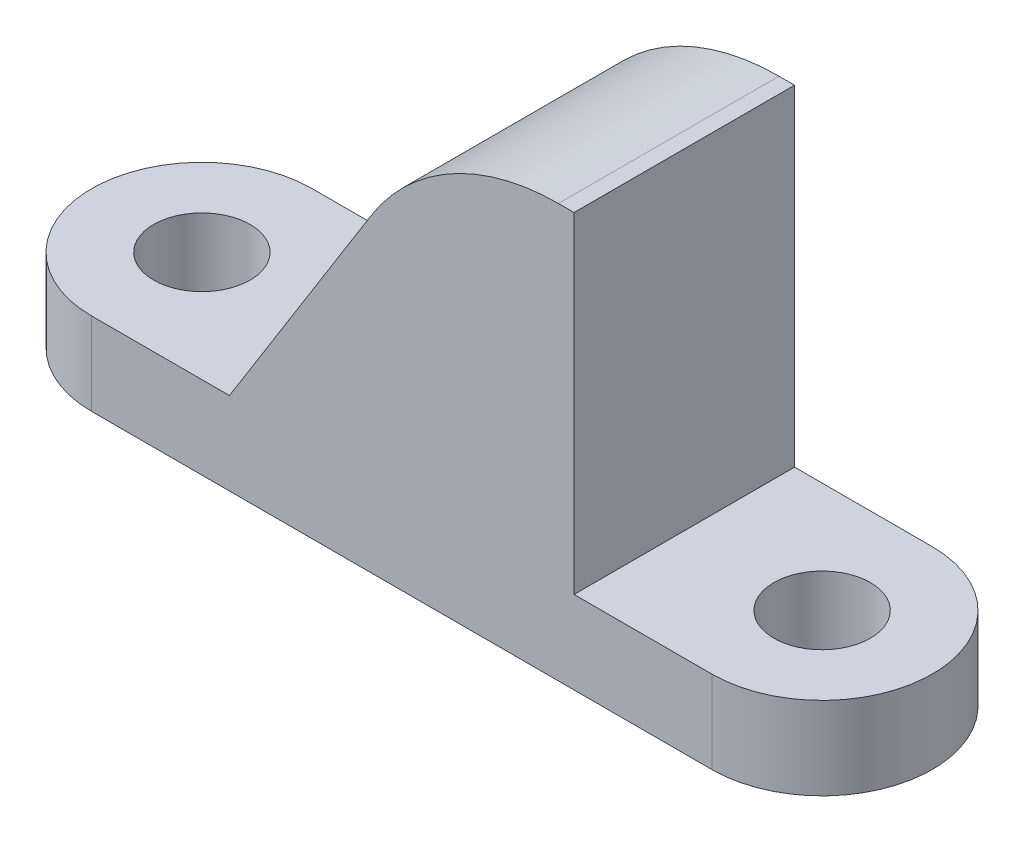
ISO-10303-21;
HEADER;
FILE_DESCRIPTION(('STEP AP214'),'2;1');
FILE_NAME('part.step','',(''),(''),'','','');
FILE_SCHEMA(('AUTOMOTIVE_DESIGN { 1 0 10303 214 1 1 1 1 }'));
ENDSEC;
DATA;
#1=APPLICATION_CONTEXT('core data for automotive mechanical design processes');
#2=APPLICATION_PROTOCOL_DEFINITION('international standard','automotive_design',2000,#1);
#3=PRODUCT_CONTEXT('',#1,'mechanical');
#4=PRODUCT('Part','Part','',(#3));
#5=PRODUCT_RELATED_PRODUCT_CATEGORY('part','',(#4));
#6=PRODUCT_DEFINITION_FORMATION('','',#4);
#7=PRODUCT_DEFINITION_CONTEXT('part definition',#1,'design');
#8=PRODUCT_DEFINITION('design','',#6,#7);
#9=PRODUCT_DEFINITION_SHAPE('','',#8);
#10=(LENGTH_UNIT() NAMED_UNIT(*) SI_UNIT(.MILLI.,.METRE.));
#11=(NAMED_UNIT(*) PLANE_ANGLE_UNIT() SI_UNIT($,.RADIAN.));
#12=(NAMED_UNIT(*) SI_UNIT($,.STERADIAN.) SOLID_ANGLE_UNIT());
#13=UNCERTAINTY_MEASURE_WITH_UNIT(LENGTH_MEASURE(1.E-05),#10,'distance_accuracy_value','');
#14=(GEOMETRIC_REPRESENTATION_CONTEXT(3) GLOBAL_UNCERTAINTY_ASSIGNED_CONTEXT((#13)) GLOBAL_UNIT_ASSIGNED_CONTEXT((#10,
#11,#12)) REPRESENTATION_CONTEXT('',''));
#15=CARTESIAN_POINT('',(0.,0.,0.));
#16=DIRECTION('',(0.,0.,1.));
#17=DIRECTION('',(1.,0.,0.));
#18=AXIS2_PLACEMENT_3D('',#15,#16,#17);
#19=CARTESIAN_POINT('',(11.25,3.,0.));
#20=DIRECTION('',(0.,-1.,0.));
#21=DIRECTION('',(0.,0.,-1.));
#22=AXIS2_PLACEMENT_3D('',#19,#20,#21);
#23=PLANE('',#22);
#24=CARTESIAN_POINT('',(11.25,3.,0.));
#25=DIRECTION('',(0.,1.,0.));
#26=DIRECTION('',(0.,0.,-1.));
#27=AXIS2_PLACEMENT_3D('',#24,#25,#26);
#28=CIRCLE('',#27,1.74999999999999);
#29=CARTESIAN_POINT('',(11.25,3.,-1.75));
#30=VERTEX_POINT('',#29);
#31=EDGE_CURVE('E182',#30,#30,#28,.T.);
#32=ORIENTED_EDGE('',*,*,#31,.F.);
#33=EDGE_LOOP('',(#32));
#34=FACE_BOUND('',#33,.T.);
#35=DIRECTION('',(0.,0.,-1.));
#36=VECTOR('',#35,1.);
#37=CARTESIAN_POINT('',(6.24999999999999,3.,4.));
#38=LINE('',#37,#36);
#39=CARTESIAN_POINT('',(6.24999999999998,3.,4.));
#40=VERTEX_POINT('',#39);
#41=CARTESIAN_POINT('',(6.24999999999998,3.,-4.));
#42=VERTEX_POINT('',#41);
#43=EDGE_CURVE('E116',#40,#42,#38,.T.);
#44=ORIENTED_EDGE('',*,*,#43,.F.);
#45=DIRECTION('',(1.,0.,0.));
#46=VECTOR('',#45,1.);
#47=CARTESIAN_POINT('',(-11.25,3.,4.));
#48=LINE('',#47,#46);
#49=CARTESIAN_POINT('',(11.25,3.,4.));
#50=VERTEX_POINT('',#49);
#51=EDGE_CURVE('E132',#40,#50,#48,.T.);
#52=ORIENTED_EDGE('',*,*,#51,.T.);
#53=CARTESIAN_POINT('',(11.25,3.,0.));
#54=DIRECTION('',(0.,1.,0.));
#55=DIRECTION('',(0.,0.,-1.));
#56=AXIS2_PLACEMENT_3D('',#53,#54,#55);
#57=CIRCLE('',#56,4.);
#58=CARTESIAN_POINT('',(11.25,3.,-4.));
#59=VERTEX_POINT('',#58);
#60=EDGE_CURVE('E123',#50,#59,#57,.T.);
#61=ORIENTED_EDGE('',*,*,#60,.T.);
#62=DIRECTION('',(-1.,0.,0.));
#63=VECTOR('',#62,1.);
#64=CARTESIAN_POINT('',(-11.25,3.,-4.));
#65=LINE('',#64,#63);
#66=EDGE_CURVE('E122',#59,#42,#65,.T.);
#67=ORIENTED_EDGE('',*,*,#66,.T.);
#68=EDGE_LOOP('',(#44,#52,#61,#67));
#69=FACE_BOUND('',#68,.T.);
#70=ADVANCED_FACE('F33',(#34,#69),#23,.F.);
#71=CARTESIAN_POINT('',(-11.25,3.,0.));
#72=DIRECTION('',(0.,1.,0.));
#73=DIRECTION('',(0.,0.,1.));
#74=AXIS2_PLACEMENT_3D('',#71,#72,#73);
#75=CIRCLE('',#74,1.75);
#76=CARTESIAN_POINT('',(-11.25,3.,1.75));
#77=VERTEX_POINT('',#76);
#78=EDGE_CURVE('E139',#77,#77,#75,.T.);
#79=ORIENTED_EDGE('',*,*,#78,.F.);
#80=EDGE_LOOP('',(#79));
#81=FACE_BOUND('',#80,.T.);
#82=CARTESIAN_POINT('',(-11.25,3.,4.));
#83=VERTEX_POINT('',#82);
#84=CARTESIAN_POINT('',(-6.24999999999999,3.,4.));
#85=VERTEX_POINT('',#84);
#86=EDGE_CURVE('E115',#83,#85,#48,.T.);
#87=ORIENTED_EDGE('',*,*,#86,.T.);
#88=DIRECTION('',(0.,0.,1.));
#89=VECTOR('',#88,1.);
#90=CARTESIAN_POINT('',(-6.24999999999999,3.,-4.));
#91=LINE('',#90,#89);
#92=CARTESIAN_POINT('',(-6.24999999999999,3.,-4.));
#93=VERTEX_POINT('',#92);
#94=EDGE_CURVE('E103',#93,#85,#91,.T.);
#95=ORIENTED_EDGE('',*,*,#94,.F.);
#96=CARTESIAN_POINT('',(-11.25,3.,-4.));
#97=VERTEX_POINT('',#96);
#98=EDGE_CURVE('E112',#93,#97,#65,.T.);
#99=ORIENTED_EDGE('',*,*,#98,.T.);
#100=CARTESIAN_POINT('',(-11.25,3.,0.));
#101=DIRECTION('',(0.,1.,0.));
#102=DIRECTION('',(0.,0.,1.));
#103=AXIS2_PLACEMENT_3D('',#100,#101,#102);
#104=CIRCLE('',#103,4.);
#105=EDGE_CURVE('E125',#97,#83,#104,.T.);
#106=ORIENTED_EDGE('',*,*,#105,.T.);
#107=EDGE_LOOP('',(#87,#95,#99,#106));
#108=FACE_BOUND('',#107,.T.);
#109=ADVANCED_FACE('F111',(#81,#108),#23,.F.);
#110=CARTESIAN_POINT('',(11.25,0.,0.));
#111=DIRECTION('',(0.,-1.,0.));
#112=DIRECTION('',(0.,0.,-1.));
#113=AXIS2_PLACEMENT_3D('',#110,#111,#112);
#114=PLANE('',#113);
#115=CARTESIAN_POINT('',(-11.25,0.,0.));
#116=DIRECTION('',(0.,1.,0.));
#117=DIRECTION('',(0.,0.,1.));
#118=AXIS2_PLACEMENT_3D('',#115,#116,#117);
#119=CIRCLE('',#118,1.75);
#120=CARTESIAN_POINT('',(-11.25,0.,1.75));
#121=VERTEX_POINT('',#120);
#122=EDGE_CURVE('E185',#121,#121,#119,.T.);
#123=ORIENTED_EDGE('',*,*,#122,.T.);
#124=EDGE_LOOP('',(#123));
#125=FACE_BOUND('',#124,.T.);
#126=CARTESIAN_POINT('',(11.25,0.,0.));
#127=DIRECTION('',(0.,1.,0.));
#128=DIRECTION('',(0.,0.,-1.));
#129=AXIS2_PLACEMENT_3D('',#126,#127,#128);
#130=CIRCLE('',#129,4.);
#131=CARTESIAN_POINT('',(11.25,0.,4.));
#132=VERTEX_POINT('',#131);
#133=CARTESIAN_POINT('',(11.25,0.,-4.));
#134=VERTEX_POINT('',#133);
#135=EDGE_CURVE('E135',#132,#134,#130,.T.);
#136=ORIENTED_EDGE('',*,*,#135,.F.);
#137=DIRECTION('',(1.,0.,0.));
#138=VECTOR('',#137,1.);
#139=CARTESIAN_POINT('',(-11.25,0.,4.));
#140=LINE('',#139,#138);
#141=CARTESIAN_POINT('',(-11.25,0.,4.));
#142=VERTEX_POINT('',#141);
#143=EDGE_CURVE('E127',#142,#132,#140,.T.);
#144=ORIENTED_EDGE('',*,*,#143,.F.);
#145=CARTESIAN_POINT('',(-11.25,0.,0.));
#146=DIRECTION('',(0.,1.,0.));
#147=DIRECTION('',(0.,0.,1.));
#148=AXIS2_PLACEMENT_3D('',#145,#146,#147);
#149=CIRCLE('',#148,4.);
#150=CARTESIAN_POINT('',(-11.25,0.,-4.));
#151=VERTEX_POINT('',#150);
#152=EDGE_CURVE('E141',#151,#142,#149,.T.);
#153=ORIENTED_EDGE('',*,*,#152,.F.);
#154=DIRECTION('',(-1.,0.,0.));
#155=VECTOR('',#154,1.);
#156=CARTESIAN_POINT('',(-11.25,0.,-4.));
#157=LINE('',#156,#155);
#158=EDGE_CURVE('E138',#134,#151,#157,.T.);
#159=ORIENTED_EDGE('',*,*,#158,.F.);
#160=EDGE_LOOP('',(#136,#144,#153,#159));
#161=FACE_BOUND('',#160,.T.);
#162=CARTESIAN_POINT('',(11.25,0.,0.));
#163=DIRECTION('',(0.,1.,0.));
#164=DIRECTION('',(0.,0.,-1.));
#165=AXIS2_PLACEMENT_3D('',#162,#163,#164);
#166=CIRCLE('',#165,1.74999999999999);
#167=CARTESIAN_POINT('',(11.25,0.,-1.75));
#168=VERTEX_POINT('',#167);
#169=EDGE_CURVE('E181',#168,#168,#166,.T.);
#170=ORIENTED_EDGE('',*,*,#169,.T.);
#171=EDGE_LOOP('',(#170));
#172=FACE_BOUND('',#171,.T.);
#173=ADVANCED_FACE('F192',(#125,#161,#172),#114,.T.);
#174=CARTESIAN_POINT('',(11.25,3.,0.));
#175=DIRECTION('',(0.,-1.,0.));
#176=DIRECTION('',(0.,0.,-1.));
#177=AXIS2_PLACEMENT_3D('',#174,#175,#176);
#178=CYLINDRICAL_SURFACE('',#177,4.);
#179=ORIENTED_EDGE('',*,*,#135,.T.);
#180=DIRECTION('',(0.,-1.,0.));
#181=VECTOR('',#180,1.);
#182=CARTESIAN_POINT('',(11.25,3.,-4.));
#183=LINE('',#182,#181);
#184=EDGE_CURVE('E150',#59,#134,#183,.T.);
#185=ORIENTED_EDGE('',*,*,#184,.F.);
#186=ORIENTED_EDGE('',*,*,#60,.F.);
#187=DIRECTION('',(0.,-1.,0.));
#188=VECTOR('',#187,1.);
#189=CARTESIAN_POINT('',(11.25,3.,4.));
#190=LINE('',#189,#188);
#191=EDGE_CURVE('E134',#50,#132,#190,.T.);
#192=ORIENTED_EDGE('',*,*,#191,.T.);
#193=EDGE_LOOP('',(#179,#185,#186,#192));
#194=FACE_BOUND('',#193,.T.);
#195=ADVANCED_FACE('F220',(#194),#178,.T.);
#196=CARTESIAN_POINT('',(-11.25,3.,-4.));
#197=DIRECTION('',(0.,0.,1.));
#198=DIRECTION('',(1.,0.,0.));
#199=AXIS2_PLACEMENT_3D('',#196,#197,#198);
#200=PLANE('',#199);
#201=DIRECTION('',(-0.529998940003179,-0.847998304005089,0.));
#202=VECTOR('',#201,1.);
#203=CARTESIAN_POINT('',(1.24999999999999,15.,-4.));
#204=LINE('',#203,#202);
#205=CARTESIAN_POINT('',(-1.10000529998411,11.2399915200254,-4.));
#206=VERTEX_POINT('',#205);
#207=EDGE_CURVE('E100',#206,#93,#204,.T.);
#208=ORIENTED_EDGE('',*,*,#207,.F.);
#209=CARTESIAN_POINT('',(5.6839811320566,7.,-4.));
#210=DIRECTION('',(0.,0.,1.));
#211=DIRECTION('',(1.,0.,0.));
#212=AXIS2_PLACEMENT_3D('',#209,#210,#211);
#213=CIRCLE('',#212,8.);
#214=CARTESIAN_POINT('',(5.6839811320566,15.,-4.));
#215=VERTEX_POINT('',#214);
#216=EDGE_CURVE('E11',#206,#215,#213,.F.);
#217=ORIENTED_EDGE('',*,*,#216,.T.);
#218=DIRECTION('',(-1.,0.,0.));
#219=VECTOR('',#218,1.);
#220=CARTESIAN_POINT('',(1.24999999999999,15.,-4.));
#221=LINE('',#220,#219);
#222=CARTESIAN_POINT('',(6.24999999999999,15.,-4.));
#223=VERTEX_POINT('',#222);
#224=EDGE_CURVE('E163',#223,#215,#221,.T.);
#225=ORIENTED_EDGE('',*,*,#224,.F.);
#226=DIRECTION('',(0.,-1.,0.));
#227=VECTOR('',#226,1.);
#228=CARTESIAN_POINT('',(6.24999999999999,15.,-4.));
#229=LINE('',#228,#227);
#230=EDGE_CURVE('E171',#223,#42,#229,.T.);
#231=ORIENTED_EDGE('',*,*,#230,.T.);
#232=ORIENTED_EDGE('',*,*,#66,.F.);
#233=ORIENTED_EDGE('',*,*,#184,.T.);
#234=ORIENTED_EDGE('',*,*,#158,.T.);
#235=DIRECTION('',(0.,-1.,0.));
#236=VECTOR('',#235,1.);
#237=CARTESIAN_POINT('',(-11.25,3.,-4.));
#238=LINE('',#237,#236);
#239=EDGE_CURVE('E120',#97,#151,#238,.T.);
#240=ORIENTED_EDGE('',*,*,#239,.F.);
#241=ORIENTED_EDGE('',*,*,#98,.F.);
#242=EDGE_LOOP('',(#208,#217,#225,#231,#232,#233,#234,#240,#241));
#243=FACE_BOUND('',#242,.T.);
#244=ADVANCED_FACE('F118',(#243),#200,.F.);
#245=CARTESIAN_POINT('',(-11.25,3.,0.));
#246=DIRECTION('',(0.,-1.,0.));
#247=DIRECTION('',(0.,0.,-1.));
#248=AXIS2_PLACEMENT_3D('',#245,#246,#247);
#249=CYLINDRICAL_SURFACE('',#248,4.);
#250=ORIENTED_EDGE('',*,*,#152,.T.);
#251=DIRECTION('',(0.,-1.,0.));
#252=VECTOR('',#251,1.);
#253=CARTESIAN_POINT('',(-11.25,3.,4.));
#254=LINE('',#253,#252);
#255=EDGE_CURVE('E146',#83,#142,#254,.T.);
#256=ORIENTED_EDGE('',*,*,#255,.F.);
#257=ORIENTED_EDGE('',*,*,#105,.F.);
#258=ORIENTED_EDGE('',*,*,#239,.T.);
#259=EDGE_LOOP('',(#250,#256,#257,#258));
#260=FACE_BOUND('',#259,.T.);
#261=ADVANCED_FACE('F207',(#260),#249,.T.);
#262=CARTESIAN_POINT('',(-11.25,3.,4.));
#263=DIRECTION('',(0.,0.,-1.));
#264=DIRECTION('',(-1.,0.,0.));
#265=AXIS2_PLACEMENT_3D('',#262,#263,#264);
#266=PLANE('',#265);
#267=DIRECTION('',(1.,0.,0.));
#268=VECTOR('',#267,1.);
#269=CARTESIAN_POINT('',(1.24999999999999,15.,4.));
#270=LINE('',#269,#268);
#271=CARTESIAN_POINT('',(5.6839811320566,15.,4.));
#272=VERTEX_POINT('',#271);
#273=CARTESIAN_POINT('',(6.24999999999999,15.,4.));
#274=VERTEX_POINT('',#273);
#275=EDGE_CURVE('E161',#272,#274,#270,.T.);
#276=ORIENTED_EDGE('',*,*,#275,.F.);
#277=CARTESIAN_POINT('',(5.6839811320566,7.,4.));
#278=DIRECTION('',(0.,0.,-1.));
#279=DIRECTION('',(-1.,0.,0.));
#280=AXIS2_PLACEMENT_3D('',#277,#278,#279);
#281=CIRCLE('',#280,8.);
#282=CARTESIAN_POINT('',(-1.10000529998411,11.2399915200254,4.));
#283=VERTEX_POINT('',#282);
#284=EDGE_CURVE('E55',#272,#283,#281,.F.);
#285=ORIENTED_EDGE('',*,*,#284,.T.);
#286=DIRECTION('',(-0.529998940003179,-0.847998304005089,0.));
#287=VECTOR('',#286,1.);
#288=CARTESIAN_POINT('',(1.24999999999999,15.,4.));
#289=LINE('',#288,#287);
#290=EDGE_CURVE('E108',#283,#85,#289,.T.);
#291=ORIENTED_EDGE('',*,*,#290,.T.);
#292=ORIENTED_EDGE('',*,*,#86,.F.);
#293=ORIENTED_EDGE('',*,*,#255,.T.);
#294=ORIENTED_EDGE('',*,*,#143,.T.);
#295=ORIENTED_EDGE('',*,*,#191,.F.);
#296=ORIENTED_EDGE('',*,*,#51,.F.);
#297=DIRECTION('',(0.,-1.,0.));
#298=VECTOR('',#297,1.);
#299=CARTESIAN_POINT('',(6.24999999999999,15.,4.));
#300=LINE('',#299,#298);
#301=EDGE_CURVE('E168',#274,#40,#300,.T.);
#302=ORIENTED_EDGE('',*,*,#301,.F.);
#303=EDGE_LOOP('',(#276,#285,#291,#292,#293,#294,#295,#296,#302));
#304=FACE_BOUND('',#303,.T.);
#305=ADVANCED_FACE('F165',(#304),#266,.F.);
#306=CARTESIAN_POINT('',(-11.25,3.,0.));
#307=DIRECTION('',(0.,-1.,0.));
#308=DIRECTION('',(0.,0.,-1.));
#309=AXIS2_PLACEMENT_3D('',#306,#307,#308);
#310=CYLINDRICAL_SURFACE('',#309,1.75);
#311=ORIENTED_EDGE('',*,*,#78,.T.);
#312=EDGE_LOOP('',(#311));
#313=FACE_BOUND('',#312,.T.);
#314=ORIENTED_EDGE('',*,*,#122,.F.);
#315=EDGE_LOOP('',(#314));
#316=FACE_BOUND('',#315,.T.);
#317=ADVANCED_FACE('F195',(#313,#316),#310,.F.);
#318=CARTESIAN_POINT('',(11.25,3.,0.));
#319=DIRECTION('',(0.,-1.,0.));
#320=DIRECTION('',(0.,0.,-1.));
#321=AXIS2_PLACEMENT_3D('',#318,#319,#320);
#322=CYLINDRICAL_SURFACE('',#321,1.74999999999999);
#323=ORIENTED_EDGE('',*,*,#31,.T.);
#324=EDGE_LOOP('',(#323));
#325=FACE_BOUND('',#324,.T.);
#326=ORIENTED_EDGE('',*,*,#169,.F.);
#327=EDGE_LOOP('',(#326));
#328=FACE_BOUND('',#327,.T.);
#329=ADVANCED_FACE('F197',(#325,#328),#322,.F.);
#330=CARTESIAN_POINT('',(6.24999999999999,15.,4.));
#331=DIRECTION('',(-1.,0.,0.));
#332=DIRECTION('',(0.,0.,1.));
#333=AXIS2_PLACEMENT_3D('',#330,#331,#332);
#334=PLANE('',#333);
#335=ORIENTED_EDGE('',*,*,#43,.T.);
#336=ORIENTED_EDGE('',*,*,#230,.F.);
#337=DIRECTION('',(0.,0.,-1.));
#338=VECTOR('',#337,1.);
#339=CARTESIAN_POINT('',(6.24999999999999,15.,4.));
#340=LINE('',#339,#338);
#341=EDGE_CURVE('E173',#274,#223,#340,.T.);
#342=ORIENTED_EDGE('',*,*,#341,.F.);
#343=ORIENTED_EDGE('',*,*,#301,.T.);
#344=EDGE_LOOP('',(#335,#336,#342,#343));
#345=FACE_BOUND('',#344,.T.);
#346=ADVANCED_FACE('F204',(#345),#334,.F.);
#347=CARTESIAN_POINT('',(0.,15.,0.));
#348=DIRECTION('',(0.,-1.,0.));
#349=DIRECTION('',(0.,0.,-1.));
#350=AXIS2_PLACEMENT_3D('',#347,#348,#349);
#351=PLANE('',#350);
#352=ORIENTED_EDGE('',*,*,#224,.T.);
#353=DIRECTION('',(0.,0.,1.));
#354=VECTOR('',#353,1.);
#355=CARTESIAN_POINT('',(5.6839811320566,15.,4.));
#356=LINE('',#355,#354);
#357=EDGE_CURVE('E153',#215,#272,#356,.T.);
#358=ORIENTED_EDGE('',*,*,#357,.T.);
#359=ORIENTED_EDGE('',*,*,#275,.T.);
#360=ORIENTED_EDGE('',*,*,#341,.T.);
#361=EDGE_LOOP('',(#352,#358,#359,#360));
#362=FACE_BOUND('',#361,.T.);
#363=ADVANCED_FACE('F159',(#362),#351,.F.);
#364=CARTESIAN_POINT('',(1.24999999999999,15.,-4.));
#365=DIRECTION('',(-0.847998304005089,0.529998940003179,0.));
#366=DIRECTION('',(-0.529998940003179,-0.847998304005089,0.));
#367=AXIS2_PLACEMENT_3D('',#364,#365,#366);
#368=PLANE('',#367);
#369=ORIENTED_EDGE('',*,*,#290,.F.);
#370=DIRECTION('',(0.,0.,1.));
#371=VECTOR('',#370,1.);
#372=CARTESIAN_POINT('',(-1.10000529998411,11.2399915200254,-4.));
#373=LINE('',#372,#371);
#374=EDGE_CURVE('E41',#283,#206,#373,.F.);
#375=ORIENTED_EDGE('',*,*,#374,.T.);
#376=ORIENTED_EDGE('',*,*,#207,.T.);
#377=ORIENTED_EDGE('',*,*,#94,.T.);
#378=EDGE_LOOP('',(#369,#375,#376,#377));
#379=FACE_BOUND('',#378,.T.);
#380=ADVANCED_FACE('F102',(#379),#368,.T.);
#381=CARTESIAN_POINT('',(5.6839811320566,7.,0.));
#382=DIRECTION('',(0.,0.,-1.));
#383=DIRECTION('',(-1.,0.,0.));
#384=AXIS2_PLACEMENT_3D('',#381,#382,#383);
#385=CYLINDRICAL_SURFACE('',#384,8.);
#386=ORIENTED_EDGE('',*,*,#216,.F.);
#387=ORIENTED_EDGE('',*,*,#374,.F.);
#388=ORIENTED_EDGE('',*,*,#284,.F.);
#389=ORIENTED_EDGE('',*,*,#357,.F.);
#390=EDGE_LOOP('',(#386,#387,#388,#389));
#391=FACE_BOUND('',#390,.T.);
#392=ADVANCED_FACE('F35',(#391),#385,.T.);
#393=CLOSED_SHELL('',(#70,#109,#173,#195,#244,#261,#305,#317,#329,#346,#363,#380,#392));
#394=MANIFOLD_SOLID_BREP('B2',#393);
#395=ADVANCED_BREP_SHAPE_REPRESENTATION('',(#18,#394),#14);
#396=SHAPE_DEFINITION_REPRESENTATION(#9,#395);
ENDSEC;
END-ISO-10303-21;
